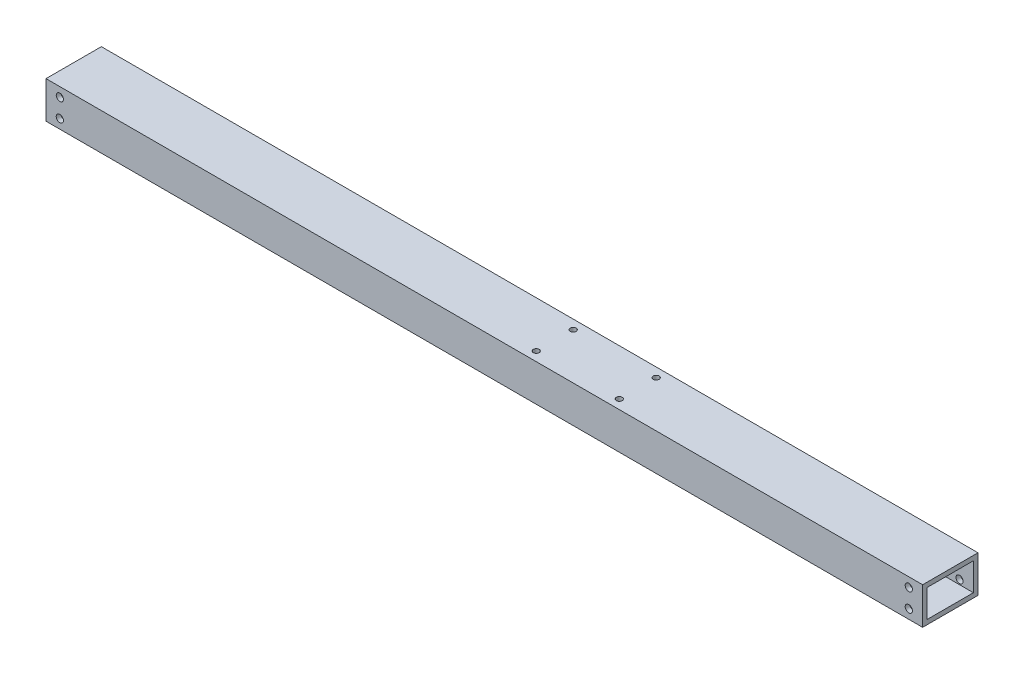
ISO-10303-21;
HEADER;
FILE_DESCRIPTION(('STEP AP214'),'2;1');
FILE_NAME('part.step','',(''),(''),'','','');
FILE_SCHEMA(('AUTOMOTIVE_DESIGN { 1 0 10303 214 1 1 1 1 }'));
ENDSEC;
DATA;
#1=APPLICATION_CONTEXT('core data for automotive mechanical design processes');
#2=APPLICATION_PROTOCOL_DEFINITION('international standard','automotive_design',2000,#1);
#3=PRODUCT_CONTEXT('',#1,'mechanical');
#4=PRODUCT('Part','Part','',(#3));
#5=PRODUCT_RELATED_PRODUCT_CATEGORY('part','',(#4));
#6=PRODUCT_DEFINITION_FORMATION('','',#4);
#7=PRODUCT_DEFINITION_CONTEXT('part definition',#1,'design');
#8=PRODUCT_DEFINITION('design','',#6,#7);
#9=PRODUCT_DEFINITION_SHAPE('','',#8);
#10=(LENGTH_UNIT() NAMED_UNIT(*) SI_UNIT(.MILLI.,.METRE.));
#11=(NAMED_UNIT(*) PLANE_ANGLE_UNIT() SI_UNIT($,.RADIAN.));
#12=(NAMED_UNIT(*) SI_UNIT($,.STERADIAN.) SOLID_ANGLE_UNIT());
#13=UNCERTAINTY_MEASURE_WITH_UNIT(LENGTH_MEASURE(1.E-05),#10,'distance_accuracy_value','');
#14=(GEOMETRIC_REPRESENTATION_CONTEXT(3) GLOBAL_UNCERTAINTY_ASSIGNED_CONTEXT((#13)) GLOBAL_UNIT_ASSIGNED_CONTEXT((#10,
#11,#12)) REPRESENTATION_CONTEXT('',''));
#15=CARTESIAN_POINT('',(0.,0.,0.));
#16=DIRECTION('',(0.,0.,1.));
#17=DIRECTION('',(1.,0.,0.));
#18=AXIS2_PLACEMENT_3D('',#15,#16,#17);
#19=CARTESIAN_POINT('',(301.625,0.,0.));
#20=DIRECTION('',(1.,0.,0.));
#21=DIRECTION('',(0.,0.,-1.));
#22=AXIS2_PLACEMENT_3D('',#19,#20,#21);
#23=PLANE('',#22);
#24=DIRECTION('',(0.,1.,0.));
#25=VECTOR('',#24,1.);
#26=CARTESIAN_POINT('',(301.625,12.7,-19.05));
#27=LINE('',#26,#25);
#28=CARTESIAN_POINT('',(301.625,-12.7,-19.05));
#29=VERTEX_POINT('',#28);
#30=CARTESIAN_POINT('',(301.625,12.7,-19.05));
#31=VERTEX_POINT('',#30);
#32=EDGE_CURVE('E139',#29,#31,#27,.T.);
#33=ORIENTED_EDGE('',*,*,#32,.T.);
#34=DIRECTION('',(0.,0.,1.));
#35=VECTOR('',#34,1.);
#36=CARTESIAN_POINT('',(301.625,12.7,19.05));
#37=LINE('',#36,#35);
#38=CARTESIAN_POINT('',(301.625,12.7,19.05));
#39=VERTEX_POINT('',#38);
#40=EDGE_CURVE('E142',#31,#39,#37,.T.);
#41=ORIENTED_EDGE('',*,*,#40,.T.);
#42=DIRECTION('',(0.,-1.,0.));
#43=VECTOR('',#42,1.);
#44=CARTESIAN_POINT('',(301.625,12.7,19.05));
#45=LINE('',#44,#43);
#46=CARTESIAN_POINT('',(301.625,-12.7,19.05));
#47=VERTEX_POINT('',#46);
#48=EDGE_CURVE('E145',#39,#47,#45,.T.);
#49=ORIENTED_EDGE('',*,*,#48,.T.);
#50=DIRECTION('',(0.,0.,-1.));
#51=VECTOR('',#50,1.);
#52=CARTESIAN_POINT('',(301.625,-12.7,19.05));
#53=LINE('',#52,#51);
#54=EDGE_CURVE('E147',#47,#29,#53,.T.);
#55=ORIENTED_EDGE('',*,*,#54,.T.);
#56=EDGE_LOOP('',(#33,#41,#49,#55));
#57=FACE_BOUND('',#56,.T.);
#58=DIRECTION('',(0.,-1.,0.));
#59=VECTOR('',#58,1.);
#60=CARTESIAN_POINT('',(301.625,9.525,15.875));
#61=LINE('',#60,#59);
#62=CARTESIAN_POINT('',(301.625,9.525,15.875));
#63=VERTEX_POINT('',#62);
#64=CARTESIAN_POINT('',(301.625,-9.525,15.875));
#65=VERTEX_POINT('',#64);
#66=EDGE_CURVE('E109',#63,#65,#61,.T.);
#67=ORIENTED_EDGE('',*,*,#66,.F.);
#68=DIRECTION('',(0.,0.,1.));
#69=VECTOR('',#68,1.);
#70=CARTESIAN_POINT('',(301.625,9.525,15.875));
#71=LINE('',#70,#69);
#72=CARTESIAN_POINT('',(301.625,9.525,-15.875));
#73=VERTEX_POINT('',#72);
#74=EDGE_CURVE('E101',#73,#63,#71,.T.);
#75=ORIENTED_EDGE('',*,*,#74,.F.);
#76=DIRECTION('',(0.,1.,0.));
#77=VECTOR('',#76,1.);
#78=CARTESIAN_POINT('',(301.625,9.525,-15.875));
#79=LINE('',#78,#77);
#80=CARTESIAN_POINT('',(301.625,-9.525,-15.875));
#81=VERTEX_POINT('',#80);
#82=EDGE_CURVE('E123',#81,#73,#79,.T.);
#83=ORIENTED_EDGE('',*,*,#82,.F.);
#84=DIRECTION('',(0.,0.,-1.));
#85=VECTOR('',#84,1.);
#86=CARTESIAN_POINT('',(301.625,-9.525,15.875));
#87=LINE('',#86,#85);
#88=EDGE_CURVE('E121',#65,#81,#87,.T.);
#89=ORIENTED_EDGE('',*,*,#88,.F.);
#90=EDGE_LOOP('',(#67,#75,#83,#89));
#91=FACE_BOUND('',#90,.T.);
#92=ADVANCED_FACE('F34',(#57,#91),#23,.T.);
#93=CARTESIAN_POINT('',(-301.625,0.,0.));
#94=DIRECTION('',(1.,0.,0.));
#95=DIRECTION('',(0.,0.,-1.));
#96=AXIS2_PLACEMENT_3D('',#93,#94,#95);
#97=PLANE('',#96);
#98=DIRECTION('',(0.,1.,0.));
#99=VECTOR('',#98,1.);
#100=CARTESIAN_POINT('',(-301.625,12.7,-19.05));
#101=LINE('',#100,#99);
#102=CARTESIAN_POINT('',(-301.625,-12.7,-19.05));
#103=VERTEX_POINT('',#102);
#104=CARTESIAN_POINT('',(-301.625,12.7,-19.05));
#105=VERTEX_POINT('',#104);
#106=EDGE_CURVE('E117',#103,#105,#101,.T.);
#107=ORIENTED_EDGE('',*,*,#106,.F.);
#108=DIRECTION('',(0.,0.,-1.));
#109=VECTOR('',#108,1.);
#110=CARTESIAN_POINT('',(-301.625,-12.7,19.05));
#111=LINE('',#110,#109);
#112=CARTESIAN_POINT('',(-301.625,-12.7,19.05));
#113=VERTEX_POINT('',#112);
#114=EDGE_CURVE('E143',#113,#103,#111,.T.);
#115=ORIENTED_EDGE('',*,*,#114,.F.);
#116=DIRECTION('',(0.,-1.,0.));
#117=VECTOR('',#116,1.);
#118=CARTESIAN_POINT('',(-301.625,12.7,19.05));
#119=LINE('',#118,#117);
#120=CARTESIAN_POINT('',(-301.625,12.7,19.05));
#121=VERTEX_POINT('',#120);
#122=EDGE_CURVE('E154',#121,#113,#119,.T.);
#123=ORIENTED_EDGE('',*,*,#122,.F.);
#124=DIRECTION('',(0.,0.,1.));
#125=VECTOR('',#124,1.);
#126=CARTESIAN_POINT('',(-301.625,12.7,19.05));
#127=LINE('',#126,#125);
#128=EDGE_CURVE('E152',#105,#121,#127,.T.);
#129=ORIENTED_EDGE('',*,*,#128,.F.);
#130=EDGE_LOOP('',(#107,#115,#123,#129));
#131=FACE_BOUND('',#130,.T.);
#132=DIRECTION('',(0.,0.,1.));
#133=VECTOR('',#132,1.);
#134=CARTESIAN_POINT('',(-301.625,9.525,15.875));
#135=LINE('',#134,#133);
#136=CARTESIAN_POINT('',(-301.625,9.525,-15.875));
#137=VERTEX_POINT('',#136);
#138=CARTESIAN_POINT('',(-301.625,9.525,15.875));
#139=VERTEX_POINT('',#138);
#140=EDGE_CURVE('E59',#137,#139,#135,.T.);
#141=ORIENTED_EDGE('',*,*,#140,.T.);
#142=DIRECTION('',(0.,-1.,0.));
#143=VECTOR('',#142,1.);
#144=CARTESIAN_POINT('',(-301.625,9.525,15.875));
#145=LINE('',#144,#143);
#146=CARTESIAN_POINT('',(-301.625,-9.525,15.875));
#147=VERTEX_POINT('',#146);
#148=EDGE_CURVE('E116',#139,#147,#145,.T.);
#149=ORIENTED_EDGE('',*,*,#148,.T.);
#150=DIRECTION('',(0.,0.,-1.));
#151=VECTOR('',#150,1.);
#152=CARTESIAN_POINT('',(-301.625,-9.525,15.875));
#153=LINE('',#152,#151);
#154=CARTESIAN_POINT('',(-301.625,-9.525,-15.875));
#155=VERTEX_POINT('',#154);
#156=EDGE_CURVE('E131',#147,#155,#153,.T.);
#157=ORIENTED_EDGE('',*,*,#156,.T.);
#158=DIRECTION('',(0.,1.,0.));
#159=VECTOR('',#158,1.);
#160=CARTESIAN_POINT('',(-301.625,9.525,-15.875));
#161=LINE('',#160,#159);
#162=EDGE_CURVE('E110',#155,#137,#161,.T.);
#163=ORIENTED_EDGE('',*,*,#162,.T.);
#164=EDGE_LOOP('',(#141,#149,#157,#163));
#165=FACE_BOUND('',#164,.T.);
#166=ADVANCED_FACE('F271',(#131,#165),#97,.F.);
#167=CARTESIAN_POINT('',(301.625,12.7,-19.05));
#168=DIRECTION('',(0.,0.,1.));
#169=DIRECTION('',(0.,-1.,0.));
#170=AXIS2_PLACEMENT_3D('',#167,#168,#169);
#171=PLANE('',#170);
#172=CARTESIAN_POINT('',(292.1,6.35,-19.05));
#173=DIRECTION('',(0.,0.,-1.));
#174=DIRECTION('',(-1.,0.,0.));
#175=AXIS2_PLACEMENT_3D('',#172,#173,#174);
#176=CIRCLE('',#175,2.48920000000001);
#177=CARTESIAN_POINT('',(289.6108,6.35,-19.05));
#178=VERTEX_POINT('',#177);
#179=EDGE_CURVE('E176',#178,#178,#176,.T.);
#180=ORIENTED_EDGE('',*,*,#179,.F.);
#181=EDGE_LOOP('',(#180));
#182=FACE_BOUND('',#181,.T.);
#183=CARTESIAN_POINT('',(292.1,-6.35,-19.05));
#184=DIRECTION('',(0.,0.,-1.));
#185=DIRECTION('',(-1.,0.,0.));
#186=AXIS2_PLACEMENT_3D('',#183,#184,#185);
#187=CIRCLE('',#186,2.48920000000001);
#188=CARTESIAN_POINT('',(289.6108,-6.35,-19.05));
#189=VERTEX_POINT('',#188);
#190=EDGE_CURVE('E212',#189,#189,#187,.T.);
#191=ORIENTED_EDGE('',*,*,#190,.F.);
#192=EDGE_LOOP('',(#191));
#193=FACE_BOUND('',#192,.T.);
#194=CARTESIAN_POINT('',(-292.1,6.35,-19.05));
#195=DIRECTION('',(0.,0.,1.));
#196=DIRECTION('',(1.,0.,0.));
#197=AXIS2_PLACEMENT_3D('',#194,#195,#196);
#198=CIRCLE('',#197,2.48920000000001);
#199=CARTESIAN_POINT('',(-289.6108,6.35,-19.05));
#200=VERTEX_POINT('',#199);
#201=EDGE_CURVE('E168',#200,#200,#198,.T.);
#202=ORIENTED_EDGE('',*,*,#201,.T.);
#203=EDGE_LOOP('',(#202));
#204=FACE_BOUND('',#203,.T.);
#205=CARTESIAN_POINT('',(-292.1,-6.35,-19.05));
#206=DIRECTION('',(0.,0.,1.));
#207=DIRECTION('',(1.,0.,0.));
#208=AXIS2_PLACEMENT_3D('',#205,#206,#207);
#209=CIRCLE('',#208,2.48920000000001);
#210=CARTESIAN_POINT('',(-289.6108,-6.35,-19.05));
#211=VERTEX_POINT('',#210);
#212=EDGE_CURVE('E227',#211,#211,#209,.T.);
#213=ORIENTED_EDGE('',*,*,#212,.T.);
#214=EDGE_LOOP('',(#213));
#215=FACE_BOUND('',#214,.T.);
#216=ORIENTED_EDGE('',*,*,#106,.T.);
#217=DIRECTION('',(-1.,0.,0.));
#218=VECTOR('',#217,1.);
#219=CARTESIAN_POINT('',(301.625,12.7,-19.05));
#220=LINE('',#219,#218);
#221=EDGE_CURVE('E11',#31,#105,#220,.T.);
#222=ORIENTED_EDGE('',*,*,#221,.F.);
#223=ORIENTED_EDGE('',*,*,#32,.F.);
#224=DIRECTION('',(-1.,0.,0.));
#225=VECTOR('',#224,1.);
#226=CARTESIAN_POINT('',(301.625,-12.7,-19.05));
#227=LINE('',#226,#225);
#228=EDGE_CURVE('E149',#29,#103,#227,.T.);
#229=ORIENTED_EDGE('',*,*,#228,.T.);
#230=EDGE_LOOP('',(#216,#222,#223,#229));
#231=FACE_BOUND('',#230,.T.);
#232=ADVANCED_FACE('F36',(#182,#193,#204,#215,#231),#171,.F.);
#233=CARTESIAN_POINT('',(301.625,12.7,19.05));
#234=DIRECTION('',(0.,-1.,0.));
#235=DIRECTION('',(0.,0.,-1.));
#236=AXIS2_PLACEMENT_3D('',#233,#234,#235);
#237=PLANE('',#236);
#238=CARTESIAN_POINT('',(29.4002000000002,12.7,-12.7));
#239=DIRECTION('',(0.,-1.,0.));
#240=DIRECTION('',(0.,0.,-1.));
#241=AXIS2_PLACEMENT_3D('',#238,#239,#240);
#242=CIRCLE('',#241,2.01930000000001);
#243=CARTESIAN_POINT('',(29.4002000000002,12.7,-14.7193));
#244=VERTEX_POINT('',#243);
#245=EDGE_CURVE('E323',#244,#244,#242,.T.);
#246=ORIENTED_EDGE('',*,*,#245,.T.);
#247=EDGE_LOOP('',(#246));
#248=FACE_BOUND('',#247,.T.);
#249=CARTESIAN_POINT('',(29.4002000000002,12.7,12.7));
#250=DIRECTION('',(0.,-1.,0.));
#251=DIRECTION('',(0.,0.,-1.));
#252=AXIS2_PLACEMENT_3D('',#249,#250,#251);
#253=CIRCLE('',#252,2.01930000000001);
#254=CARTESIAN_POINT('',(29.4002000000002,12.7,10.6807));
#255=VERTEX_POINT('',#254);
#256=EDGE_CURVE('E326',#255,#255,#253,.T.);
#257=ORIENTED_EDGE('',*,*,#256,.T.);
#258=EDGE_LOOP('',(#257));
#259=FACE_BOUND('',#258,.T.);
#260=CARTESIAN_POINT('',(86.5502000000002,12.7,12.7));
#261=DIRECTION('',(0.,-1.,0.));
#262=DIRECTION('',(0.,0.,-1.));
#263=AXIS2_PLACEMENT_3D('',#260,#261,#262);
#264=CIRCLE('',#263,2.01929999999986);
#265=CARTESIAN_POINT('',(86.5502000000002,12.7,10.6807000000001));
#266=VERTEX_POINT('',#265);
#267=EDGE_CURVE('E316',#266,#266,#264,.T.);
#268=ORIENTED_EDGE('',*,*,#267,.T.);
#269=EDGE_LOOP('',(#268));
#270=FACE_BOUND('',#269,.T.);
#271=CARTESIAN_POINT('',(86.5502000000002,12.7,-12.7));
#272=DIRECTION('',(0.,-1.,0.));
#273=DIRECTION('',(0.,0.,-1.));
#274=AXIS2_PLACEMENT_3D('',#271,#272,#273);
#275=CIRCLE('',#274,2.01929999999986);
#276=CARTESIAN_POINT('',(86.5502000000002,12.7,-14.7192999999999));
#277=VERTEX_POINT('',#276);
#278=EDGE_CURVE('E185',#277,#277,#275,.T.);
#279=ORIENTED_EDGE('',*,*,#278,.T.);
#280=EDGE_LOOP('',(#279));
#281=FACE_BOUND('',#280,.T.);
#282=ORIENTED_EDGE('',*,*,#128,.T.);
#283=DIRECTION('',(-1.,0.,0.));
#284=VECTOR('',#283,1.);
#285=CARTESIAN_POINT('',(301.625,12.7,19.05));
#286=LINE('',#285,#284);
#287=EDGE_CURVE('E43',#39,#121,#286,.T.);
#288=ORIENTED_EDGE('',*,*,#287,.F.);
#289=ORIENTED_EDGE('',*,*,#40,.F.);
#290=ORIENTED_EDGE('',*,*,#221,.T.);
#291=EDGE_LOOP('',(#282,#288,#289,#290));
#292=FACE_BOUND('',#291,.T.);
#293=ADVANCED_FACE('F258',(#248,#259,#270,#281,#292),#237,.F.);
#294=CARTESIAN_POINT('',(301.625,12.7,19.05));
#295=DIRECTION('',(0.,0.,-1.));
#296=DIRECTION('',(-1.,0.,0.));
#297=AXIS2_PLACEMENT_3D('',#294,#295,#296);
#298=PLANE('',#297);
#299=CARTESIAN_POINT('',(292.1,6.35,19.05));
#300=DIRECTION('',(0.,0.,-1.));
#301=DIRECTION('',(-1.,0.,0.));
#302=AXIS2_PLACEMENT_3D('',#299,#300,#301);
#303=CIRCLE('',#302,2.48920000000001);
#304=CARTESIAN_POINT('',(289.6108,6.35,19.05));
#305=VERTEX_POINT('',#304);
#306=EDGE_CURVE('E209',#305,#305,#303,.T.);
#307=ORIENTED_EDGE('',*,*,#306,.T.);
#308=EDGE_LOOP('',(#307));
#309=FACE_BOUND('',#308,.T.);
#310=CARTESIAN_POINT('',(292.1,-6.35,19.05));
#311=DIRECTION('',(0.,0.,-1.));
#312=DIRECTION('',(-1.,0.,0.));
#313=AXIS2_PLACEMENT_3D('',#310,#311,#312);
#314=CIRCLE('',#313,2.48920000000001);
#315=CARTESIAN_POINT('',(289.6108,-6.35,19.05));
#316=VERTEX_POINT('',#315);
#317=EDGE_CURVE('E206',#316,#316,#314,.T.);
#318=ORIENTED_EDGE('',*,*,#317,.T.);
#319=EDGE_LOOP('',(#318));
#320=FACE_BOUND('',#319,.T.);
#321=CARTESIAN_POINT('',(-292.1,6.35,19.05));
#322=DIRECTION('',(0.,0.,1.));
#323=DIRECTION('',(1.,0.,0.));
#324=AXIS2_PLACEMENT_3D('',#321,#322,#323);
#325=CIRCLE('',#324,2.48920000000001);
#326=CARTESIAN_POINT('',(-289.6108,6.35,19.05));
#327=VERTEX_POINT('',#326);
#328=EDGE_CURVE('E224',#327,#327,#325,.T.);
#329=ORIENTED_EDGE('',*,*,#328,.F.);
#330=EDGE_LOOP('',(#329));
#331=FACE_BOUND('',#330,.T.);
#332=CARTESIAN_POINT('',(-292.1,-6.35,19.05));
#333=DIRECTION('',(0.,0.,1.));
#334=DIRECTION('',(1.,0.,0.));
#335=AXIS2_PLACEMENT_3D('',#332,#333,#334);
#336=CIRCLE('',#335,2.48920000000001);
#337=CARTESIAN_POINT('',(-289.6108,-6.35,19.05));
#338=VERTEX_POINT('',#337);
#339=EDGE_CURVE('E221',#338,#338,#336,.T.);
#340=ORIENTED_EDGE('',*,*,#339,.F.);
#341=EDGE_LOOP('',(#340));
#342=FACE_BOUND('',#341,.T.);
#343=ORIENTED_EDGE('',*,*,#122,.T.);
#344=DIRECTION('',(-1.,0.,0.));
#345=VECTOR('',#344,1.);
#346=CARTESIAN_POINT('',(301.625,-12.7,19.05));
#347=LINE('',#346,#345);
#348=EDGE_CURVE('E159',#47,#113,#347,.T.);
#349=ORIENTED_EDGE('',*,*,#348,.F.);
#350=ORIENTED_EDGE('',*,*,#48,.F.);
#351=ORIENTED_EDGE('',*,*,#287,.T.);
#352=EDGE_LOOP('',(#343,#349,#350,#351));
#353=FACE_BOUND('',#352,.T.);
#354=ADVANCED_FACE('F254',(#309,#320,#331,#342,#353),#298,.F.);
#355=CARTESIAN_POINT('',(301.625,-12.7,19.05));
#356=DIRECTION('',(0.,1.,0.));
#357=DIRECTION('',(0.,0.,1.));
#358=AXIS2_PLACEMENT_3D('',#355,#356,#357);
#359=PLANE('',#358);
#360=CARTESIAN_POINT('',(29.4002000000002,-12.7,-12.7));
#361=DIRECTION('',(0.,-1.,0.));
#362=DIRECTION('',(0.,0.,-1.));
#363=AXIS2_PLACEMENT_3D('',#360,#361,#362);
#364=CIRCLE('',#363,2.01930000000001);
#365=CARTESIAN_POINT('',(29.4002000000002,-12.7,-14.7193));
#366=VERTEX_POINT('',#365);
#367=EDGE_CURVE('E303',#366,#366,#364,.T.);
#368=ORIENTED_EDGE('',*,*,#367,.F.);
#369=EDGE_LOOP('',(#368));
#370=FACE_BOUND('',#369,.T.);
#371=CARTESIAN_POINT('',(29.4002000000002,-12.7,12.7));
#372=DIRECTION('',(0.,-1.,0.));
#373=DIRECTION('',(0.,0.,-1.));
#374=AXIS2_PLACEMENT_3D('',#371,#372,#373);
#375=CIRCLE('',#374,2.01930000000001);
#376=CARTESIAN_POINT('',(29.4002000000002,-12.7,10.6807));
#377=VERTEX_POINT('',#376);
#378=EDGE_CURVE('E307',#377,#377,#375,.T.);
#379=ORIENTED_EDGE('',*,*,#378,.F.);
#380=EDGE_LOOP('',(#379));
#381=FACE_BOUND('',#380,.T.);
#382=CARTESIAN_POINT('',(86.5502000000002,-12.7,12.7));
#383=DIRECTION('',(0.,-1.,0.));
#384=DIRECTION('',(0.,0.,-1.));
#385=AXIS2_PLACEMENT_3D('',#382,#383,#384);
#386=CIRCLE('',#385,2.01929999999986);
#387=CARTESIAN_POINT('',(86.5502000000002,-12.7,10.6807000000001));
#388=VERTEX_POINT('',#387);
#389=EDGE_CURVE('E311',#388,#388,#386,.T.);
#390=ORIENTED_EDGE('',*,*,#389,.F.);
#391=EDGE_LOOP('',(#390));
#392=FACE_BOUND('',#391,.T.);
#393=CARTESIAN_POINT('',(86.5502000000002,-12.7,-12.7));
#394=DIRECTION('',(0.,-1.,0.));
#395=DIRECTION('',(0.,0.,-1.));
#396=AXIS2_PLACEMENT_3D('',#393,#394,#395);
#397=CIRCLE('',#396,2.01929999999986);
#398=CARTESIAN_POINT('',(86.5502000000002,-12.7,-14.7192999999999));
#399=VERTEX_POINT('',#398);
#400=EDGE_CURVE('E314',#399,#399,#397,.T.);
#401=ORIENTED_EDGE('',*,*,#400,.F.);
#402=EDGE_LOOP('',(#401));
#403=FACE_BOUND('',#402,.T.);
#404=ORIENTED_EDGE('',*,*,#114,.T.);
#405=ORIENTED_EDGE('',*,*,#228,.F.);
#406=ORIENTED_EDGE('',*,*,#54,.F.);
#407=ORIENTED_EDGE('',*,*,#348,.T.);
#408=EDGE_LOOP('',(#404,#405,#406,#407));
#409=FACE_BOUND('',#408,.T.);
#410=ADVANCED_FACE('F257',(#370,#381,#392,#403,#409),#359,.F.);
#411=CARTESIAN_POINT('',(301.625,9.525,15.875));
#412=DIRECTION('',(0.,-1.,0.));
#413=DIRECTION('',(0.,0.,-1.));
#414=AXIS2_PLACEMENT_3D('',#411,#412,#413);
#415=PLANE('',#414);
#416=CARTESIAN_POINT('',(29.4002000000002,9.525,-12.7));
#417=DIRECTION('',(0.,-1.,0.));
#418=DIRECTION('',(0.,0.,-1.));
#419=AXIS2_PLACEMENT_3D('',#416,#417,#418);
#420=CIRCLE('',#419,2.01930000000001);
#421=CARTESIAN_POINT('',(29.4002000000002,9.525,-14.7193));
#422=VERTEX_POINT('',#421);
#423=EDGE_CURVE('E203',#422,#422,#420,.T.);
#424=ORIENTED_EDGE('',*,*,#423,.F.);
#425=EDGE_LOOP('',(#424));
#426=FACE_BOUND('',#425,.T.);
#427=CARTESIAN_POINT('',(29.4002000000002,9.525,12.7));
#428=DIRECTION('',(0.,-1.,0.));
#429=DIRECTION('',(0.,0.,-1.));
#430=AXIS2_PLACEMENT_3D('',#427,#428,#429);
#431=CIRCLE('',#430,2.01930000000001);
#432=CARTESIAN_POINT('',(29.4002000000002,9.525,10.6807));
#433=VERTEX_POINT('',#432);
#434=EDGE_CURVE('E191',#433,#433,#431,.T.);
#435=ORIENTED_EDGE('',*,*,#434,.F.);
#436=EDGE_LOOP('',(#435));
#437=FACE_BOUND('',#436,.T.);
#438=CARTESIAN_POINT('',(86.5502000000002,9.525,12.7));
#439=DIRECTION('',(0.,-1.,0.));
#440=DIRECTION('',(0.,0.,-1.));
#441=AXIS2_PLACEMENT_3D('',#438,#439,#440);
#442=CIRCLE('',#441,2.01929999999986);
#443=CARTESIAN_POINT('',(86.5502000000002,9.525,10.6807000000001));
#444=VERTEX_POINT('',#443);
#445=EDGE_CURVE('E188',#444,#444,#442,.T.);
#446=ORIENTED_EDGE('',*,*,#445,.F.);
#447=EDGE_LOOP('',(#446));
#448=FACE_BOUND('',#447,.T.);
#449=CARTESIAN_POINT('',(86.5502000000002,9.525,-12.7));
#450=DIRECTION('',(0.,-1.,0.));
#451=DIRECTION('',(0.,0.,-1.));
#452=AXIS2_PLACEMENT_3D('',#449,#450,#451);
#453=CIRCLE('',#452,2.01929999999986);
#454=CARTESIAN_POINT('',(86.5502000000002,9.525,-14.7192999999999));
#455=VERTEX_POINT('',#454);
#456=EDGE_CURVE('E184',#455,#455,#453,.T.);
#457=ORIENTED_EDGE('',*,*,#456,.F.);
#458=EDGE_LOOP('',(#457));
#459=FACE_BOUND('',#458,.T.);
#460=ORIENTED_EDGE('',*,*,#140,.F.);
#461=DIRECTION('',(-1.,0.,0.));
#462=VECTOR('',#461,1.);
#463=CARTESIAN_POINT('',(301.625,9.525,-15.875));
#464=LINE('',#463,#462);
#465=EDGE_CURVE('E105',#73,#137,#464,.T.);
#466=ORIENTED_EDGE('',*,*,#465,.F.);
#467=ORIENTED_EDGE('',*,*,#74,.T.);
#468=DIRECTION('',(-1.,0.,0.));
#469=VECTOR('',#468,1.);
#470=CARTESIAN_POINT('',(301.625,9.525,15.875));
#471=LINE('',#470,#469);
#472=EDGE_CURVE('E104',#63,#139,#471,.T.);
#473=ORIENTED_EDGE('',*,*,#472,.T.);
#474=EDGE_LOOP('',(#460,#466,#467,#473));
#475=FACE_BOUND('',#474,.T.);
#476=ADVANCED_FACE('F103',(#426,#437,#448,#459,#475),#415,.T.);
#477=CARTESIAN_POINT('',(301.625,9.525,15.875));
#478=DIRECTION('',(0.,0.,-1.));
#479=DIRECTION('',(0.,1.,0.));
#480=AXIS2_PLACEMENT_3D('',#477,#478,#479);
#481=PLANE('',#480);
#482=CARTESIAN_POINT('',(292.1,6.35,15.875));
#483=DIRECTION('',(0.,0.,-1.));
#484=DIRECTION('',(0.,1.,0.));
#485=AXIS2_PLACEMENT_3D('',#482,#483,#484);
#486=CIRCLE('',#485,2.48920000000001);
#487=CARTESIAN_POINT('',(292.1,8.83920000000001,15.875));
#488=VERTEX_POINT('',#487);
#489=EDGE_CURVE('E180',#488,#488,#486,.F.);
#490=ORIENTED_EDGE('',*,*,#489,.T.);
#491=EDGE_LOOP('',(#490));
#492=FACE_BOUND('',#491,.T.);
#493=CARTESIAN_POINT('',(292.1,-6.35,15.875));
#494=DIRECTION('',(0.,0.,-1.));
#495=DIRECTION('',(0.,1.,0.));
#496=AXIS2_PLACEMENT_3D('',#493,#494,#495);
#497=CIRCLE('',#496,2.48920000000001);
#498=CARTESIAN_POINT('',(292.1,-3.86079999999999,15.875));
#499=VERTEX_POINT('',#498);
#500=EDGE_CURVE('E175',#499,#499,#497,.F.);
#501=ORIENTED_EDGE('',*,*,#500,.T.);
#502=EDGE_LOOP('',(#501));
#503=FACE_BOUND('',#502,.T.);
#504=CARTESIAN_POINT('',(-292.1,6.35,15.875));
#505=DIRECTION('',(0.,0.,-1.));
#506=DIRECTION('',(0.,1.,0.));
#507=AXIS2_PLACEMENT_3D('',#504,#505,#506);
#508=CIRCLE('',#507,2.48920000000001);
#509=CARTESIAN_POINT('',(-292.1,8.83920000000001,15.875));
#510=VERTEX_POINT('',#509);
#511=EDGE_CURVE('E129',#510,#510,#508,.T.);
#512=ORIENTED_EDGE('',*,*,#511,.F.);
#513=EDGE_LOOP('',(#512));
#514=FACE_BOUND('',#513,.T.);
#515=CARTESIAN_POINT('',(-292.1,-6.35,15.875));
#516=DIRECTION('',(0.,0.,-1.));
#517=DIRECTION('',(0.,1.,0.));
#518=AXIS2_PLACEMENT_3D('',#515,#516,#517);
#519=CIRCLE('',#518,2.48920000000001);
#520=CARTESIAN_POINT('',(-292.1,-3.86079999999999,15.875));
#521=VERTEX_POINT('',#520);
#522=EDGE_CURVE('E167',#521,#521,#519,.T.);
#523=ORIENTED_EDGE('',*,*,#522,.F.);
#524=EDGE_LOOP('',(#523));
#525=FACE_BOUND('',#524,.T.);
#526=ORIENTED_EDGE('',*,*,#148,.F.);
#527=ORIENTED_EDGE('',*,*,#472,.F.);
#528=ORIENTED_EDGE('',*,*,#66,.T.);
#529=DIRECTION('',(-1.,0.,0.));
#530=VECTOR('',#529,1.);
#531=CARTESIAN_POINT('',(301.625,-9.525,15.875));
#532=LINE('',#531,#530);
#533=EDGE_CURVE('E118',#65,#147,#532,.T.);
#534=ORIENTED_EDGE('',*,*,#533,.T.);
#535=EDGE_LOOP('',(#526,#527,#528,#534));
#536=FACE_BOUND('',#535,.T.);
#537=ADVANCED_FACE('F113',(#492,#503,#514,#525,#536),#481,.T.);
#538=CARTESIAN_POINT('',(301.625,-9.525,15.875));
#539=DIRECTION('',(0.,1.,0.));
#540=DIRECTION('',(0.,0.,1.));
#541=AXIS2_PLACEMENT_3D('',#538,#539,#540);
#542=PLANE('',#541);
#543=CARTESIAN_POINT('',(29.4002000000002,-9.525,-12.7));
#544=DIRECTION('',(0.,1.,0.));
#545=DIRECTION('',(0.,0.,1.));
#546=AXIS2_PLACEMENT_3D('',#543,#544,#545);
#547=CIRCLE('',#546,2.01930000000001);
#548=CARTESIAN_POINT('',(29.4002000000002,-9.525,-10.6807));
#549=VERTEX_POINT('',#548);
#550=EDGE_CURVE('E38',#549,#549,#547,.T.);
#551=ORIENTED_EDGE('',*,*,#550,.F.);
#552=EDGE_LOOP('',(#551));
#553=FACE_BOUND('',#552,.T.);
#554=CARTESIAN_POINT('',(29.4002000000002,-9.525,12.7));
#555=DIRECTION('',(0.,1.,0.));
#556=DIRECTION('',(0.,0.,1.));
#557=AXIS2_PLACEMENT_3D('',#554,#555,#556);
#558=CIRCLE('',#557,2.01930000000001);
#559=CARTESIAN_POINT('',(29.4002000000002,-9.525,14.7193));
#560=VERTEX_POINT('',#559);
#561=EDGE_CURVE('E189',#560,#560,#558,.T.);
#562=ORIENTED_EDGE('',*,*,#561,.F.);
#563=EDGE_LOOP('',(#562));
#564=FACE_BOUND('',#563,.T.);
#565=CARTESIAN_POINT('',(86.5502000000002,-9.525,12.7));
#566=DIRECTION('',(0.,1.,0.));
#567=DIRECTION('',(0.,0.,1.));
#568=AXIS2_PLACEMENT_3D('',#565,#566,#567);
#569=CIRCLE('',#568,2.01929999999986);
#570=CARTESIAN_POINT('',(86.5502000000002,-9.525,14.7192999999999));
#571=VERTEX_POINT('',#570);
#572=EDGE_CURVE('E186',#571,#571,#569,.T.);
#573=ORIENTED_EDGE('',*,*,#572,.F.);
#574=EDGE_LOOP('',(#573));
#575=FACE_BOUND('',#574,.T.);
#576=CARTESIAN_POINT('',(86.5502000000002,-9.525,-12.7));
#577=DIRECTION('',(0.,1.,0.));
#578=DIRECTION('',(0.,0.,1.));
#579=AXIS2_PLACEMENT_3D('',#576,#577,#578);
#580=CIRCLE('',#579,2.01929999999986);
#581=CARTESIAN_POINT('',(86.5502000000002,-9.525,-10.6807000000001));
#582=VERTEX_POINT('',#581);
#583=EDGE_CURVE('E181',#582,#582,#580,.T.);
#584=ORIENTED_EDGE('',*,*,#583,.F.);
#585=EDGE_LOOP('',(#584));
#586=FACE_BOUND('',#585,.T.);
#587=ORIENTED_EDGE('',*,*,#156,.F.);
#588=ORIENTED_EDGE('',*,*,#533,.F.);
#589=ORIENTED_EDGE('',*,*,#88,.T.);
#590=DIRECTION('',(-1.,0.,0.));
#591=VECTOR('',#590,1.);
#592=CARTESIAN_POINT('',(301.625,-9.525,-15.875));
#593=LINE('',#592,#591);
#594=EDGE_CURVE('E51',#81,#155,#593,.T.);
#595=ORIENTED_EDGE('',*,*,#594,.T.);
#596=EDGE_LOOP('',(#587,#588,#589,#595));
#597=FACE_BOUND('',#596,.T.);
#598=ADVANCED_FACE('F241',(#553,#564,#575,#586,#597),#542,.T.);
#599=CARTESIAN_POINT('',(301.625,9.525,-15.875));
#600=DIRECTION('',(0.,0.,1.));
#601=DIRECTION('',(0.,-1.,0.));
#602=AXIS2_PLACEMENT_3D('',#599,#600,#601);
#603=PLANE('',#602);
#604=CARTESIAN_POINT('',(292.1,6.35,-15.875));
#605=DIRECTION('',(0.,0.,1.));
#606=DIRECTION('',(0.,-1.,0.));
#607=AXIS2_PLACEMENT_3D('',#604,#605,#606);
#608=CIRCLE('',#607,2.48920000000001);
#609=CARTESIAN_POINT('',(292.1,3.8608,-15.875));
#610=VERTEX_POINT('',#609);
#611=EDGE_CURVE('E177',#610,#610,#608,.F.);
#612=ORIENTED_EDGE('',*,*,#611,.T.);
#613=EDGE_LOOP('',(#612));
#614=FACE_BOUND('',#613,.T.);
#615=CARTESIAN_POINT('',(292.1,-6.35,-15.875));
#616=DIRECTION('',(0.,0.,1.));
#617=DIRECTION('',(0.,-1.,0.));
#618=AXIS2_PLACEMENT_3D('',#615,#616,#617);
#619=CIRCLE('',#618,2.48920000000001);
#620=CARTESIAN_POINT('',(292.1,-8.8392,-15.875));
#621=VERTEX_POINT('',#620);
#622=EDGE_CURVE('E172',#621,#621,#619,.F.);
#623=ORIENTED_EDGE('',*,*,#622,.T.);
#624=EDGE_LOOP('',(#623));
#625=FACE_BOUND('',#624,.T.);
#626=CARTESIAN_POINT('',(-292.1,6.35,-15.875));
#627=DIRECTION('',(0.,0.,1.));
#628=DIRECTION('',(0.,-1.,0.));
#629=AXIS2_PLACEMENT_3D('',#626,#627,#628);
#630=CIRCLE('',#629,2.48920000000001);
#631=CARTESIAN_POINT('',(-292.1,3.8608,-15.875));
#632=VERTEX_POINT('',#631);
#633=EDGE_CURVE('E169',#632,#632,#630,.T.);
#634=ORIENTED_EDGE('',*,*,#633,.F.);
#635=EDGE_LOOP('',(#634));
#636=FACE_BOUND('',#635,.T.);
#637=CARTESIAN_POINT('',(-292.1,-6.35,-15.875));
#638=DIRECTION('',(0.,0.,1.));
#639=DIRECTION('',(0.,-1.,0.));
#640=AXIS2_PLACEMENT_3D('',#637,#638,#639);
#641=CIRCLE('',#640,2.48920000000001);
#642=CARTESIAN_POINT('',(-292.1,-8.8392,-15.875));
#643=VERTEX_POINT('',#642);
#644=EDGE_CURVE('E164',#643,#643,#641,.T.);
#645=ORIENTED_EDGE('',*,*,#644,.F.);
#646=EDGE_LOOP('',(#645));
#647=FACE_BOUND('',#646,.T.);
#648=ORIENTED_EDGE('',*,*,#162,.F.);
#649=ORIENTED_EDGE('',*,*,#594,.F.);
#650=ORIENTED_EDGE('',*,*,#82,.T.);
#651=ORIENTED_EDGE('',*,*,#465,.T.);
#652=EDGE_LOOP('',(#648,#649,#650,#651));
#653=FACE_BOUND('',#652,.T.);
#654=ADVANCED_FACE('F382',(#614,#625,#636,#647,#653),#603,.T.);
#655=CARTESIAN_POINT('',(-292.1,-6.35,-19.05));
#656=DIRECTION('',(0.,0.,1.));
#657=DIRECTION('',(1.,0.,0.));
#658=AXIS2_PLACEMENT_3D('',#655,#656,#657);
#659=CYLINDRICAL_SURFACE('',#658,2.48920000000001);
#660=ORIENTED_EDGE('',*,*,#644,.T.);
#661=EDGE_LOOP('',(#660));
#662=FACE_BOUND('',#661,.T.);
#663=ORIENTED_EDGE('',*,*,#212,.F.);
#664=EDGE_LOOP('',(#663));
#665=FACE_BOUND('',#664,.T.);
#666=ADVANCED_FACE('F251',(#662,#665),#659,.F.);
#667=CARTESIAN_POINT('',(-292.1,6.35,-19.05));
#668=DIRECTION('',(0.,0.,1.));
#669=DIRECTION('',(1.,0.,0.));
#670=AXIS2_PLACEMENT_3D('',#667,#668,#669);
#671=CYLINDRICAL_SURFACE('',#670,2.48920000000001);
#672=ORIENTED_EDGE('',*,*,#633,.T.);
#673=EDGE_LOOP('',(#672));
#674=FACE_BOUND('',#673,.T.);
#675=ORIENTED_EDGE('',*,*,#201,.F.);
#676=EDGE_LOOP('',(#675));
#677=FACE_BOUND('',#676,.T.);
#678=ADVANCED_FACE('F249',(#674,#677),#671,.F.);
#679=ORIENTED_EDGE('',*,*,#522,.T.);
#680=EDGE_LOOP('',(#679));
#681=FACE_BOUND('',#680,.T.);
#682=ORIENTED_EDGE('',*,*,#339,.T.);
#683=EDGE_LOOP('',(#682));
#684=FACE_BOUND('',#683,.T.);
#685=ADVANCED_FACE('F246',(#681,#684),#659,.F.);
#686=ORIENTED_EDGE('',*,*,#511,.T.);
#687=EDGE_LOOP('',(#686));
#688=FACE_BOUND('',#687,.T.);
#689=ORIENTED_EDGE('',*,*,#328,.T.);
#690=EDGE_LOOP('',(#689));
#691=FACE_BOUND('',#690,.T.);
#692=ADVANCED_FACE('F236',(#688,#691),#671,.F.);
#693=CARTESIAN_POINT('',(292.1,-6.35,-19.05));
#694=DIRECTION('',(0.,0.,1.));
#695=DIRECTION('',(1.,0.,0.));
#696=AXIS2_PLACEMENT_3D('',#693,#694,#695);
#697=CYLINDRICAL_SURFACE('',#696,2.48920000000001);
#698=ORIENTED_EDGE('',*,*,#622,.F.);
#699=EDGE_LOOP('',(#698));
#700=FACE_BOUND('',#699,.T.);
#701=ORIENTED_EDGE('',*,*,#190,.T.);
#702=EDGE_LOOP('',(#701));
#703=FACE_BOUND('',#702,.T.);
#704=ADVANCED_FACE('F373',(#700,#703),#697,.F.);
#705=CARTESIAN_POINT('',(292.1,6.35,-19.05));
#706=DIRECTION('',(0.,0.,1.));
#707=DIRECTION('',(1.,0.,0.));
#708=AXIS2_PLACEMENT_3D('',#705,#706,#707);
#709=CYLINDRICAL_SURFACE('',#708,2.48920000000001);
#710=ORIENTED_EDGE('',*,*,#611,.F.);
#711=EDGE_LOOP('',(#710));
#712=FACE_BOUND('',#711,.T.);
#713=ORIENTED_EDGE('',*,*,#179,.T.);
#714=EDGE_LOOP('',(#713));
#715=FACE_BOUND('',#714,.T.);
#716=ADVANCED_FACE('F369',(#712,#715),#709,.F.);
#717=ORIENTED_EDGE('',*,*,#500,.F.);
#718=EDGE_LOOP('',(#717));
#719=FACE_BOUND('',#718,.T.);
#720=ORIENTED_EDGE('',*,*,#317,.F.);
#721=EDGE_LOOP('',(#720));
#722=FACE_BOUND('',#721,.T.);
#723=ADVANCED_FACE('F372',(#719,#722),#697,.F.);
#724=ORIENTED_EDGE('',*,*,#489,.F.);
#725=EDGE_LOOP('',(#724));
#726=FACE_BOUND('',#725,.T.);
#727=ORIENTED_EDGE('',*,*,#306,.F.);
#728=EDGE_LOOP('',(#727));
#729=FACE_BOUND('',#728,.T.);
#730=ADVANCED_FACE('F344',(#726,#729),#709,.F.);
#731=CARTESIAN_POINT('',(86.5502000000002,12.7,-12.7));
#732=DIRECTION('',(0.,-1.,0.));
#733=DIRECTION('',(0.,0.,-1.));
#734=AXIS2_PLACEMENT_3D('',#731,#732,#733);
#735=CYLINDRICAL_SURFACE('',#734,2.01929999999986);
#736=ORIENTED_EDGE('',*,*,#583,.T.);
#737=EDGE_LOOP('',(#736));
#738=FACE_BOUND('',#737,.T.);
#739=ORIENTED_EDGE('',*,*,#400,.T.);
#740=EDGE_LOOP('',(#739));
#741=FACE_BOUND('',#740,.T.);
#742=ADVANCED_FACE('F333',(#738,#741),#735,.F.);
#743=CARTESIAN_POINT('',(86.5502000000002,12.7,12.7));
#744=DIRECTION('',(0.,-1.,0.));
#745=DIRECTION('',(0.,0.,-1.));
#746=AXIS2_PLACEMENT_3D('',#743,#744,#745);
#747=CYLINDRICAL_SURFACE('',#746,2.01929999999986);
#748=ORIENTED_EDGE('',*,*,#572,.T.);
#749=EDGE_LOOP('',(#748));
#750=FACE_BOUND('',#749,.T.);
#751=ORIENTED_EDGE('',*,*,#389,.T.);
#752=EDGE_LOOP('',(#751));
#753=FACE_BOUND('',#752,.T.);
#754=ADVANCED_FACE('F330',(#750,#753),#747,.F.);
#755=CARTESIAN_POINT('',(29.4002000000002,12.7,12.7));
#756=DIRECTION('',(0.,-1.,0.));
#757=DIRECTION('',(0.,0.,-1.));
#758=AXIS2_PLACEMENT_3D('',#755,#756,#757);
#759=CYLINDRICAL_SURFACE('',#758,2.01930000000001);
#760=ORIENTED_EDGE('',*,*,#561,.T.);
#761=EDGE_LOOP('',(#760));
#762=FACE_BOUND('',#761,.T.);
#763=ORIENTED_EDGE('',*,*,#378,.T.);
#764=EDGE_LOOP('',(#763));
#765=FACE_BOUND('',#764,.T.);
#766=ADVANCED_FACE('F332',(#762,#765),#759,.F.);
#767=CARTESIAN_POINT('',(29.4002000000002,12.7,-12.7));
#768=DIRECTION('',(0.,-1.,0.));
#769=DIRECTION('',(0.,0.,-1.));
#770=AXIS2_PLACEMENT_3D('',#767,#768,#769);
#771=CYLINDRICAL_SURFACE('',#770,2.01930000000001);
#772=ORIENTED_EDGE('',*,*,#550,.T.);
#773=EDGE_LOOP('',(#772));
#774=FACE_BOUND('',#773,.T.);
#775=ORIENTED_EDGE('',*,*,#367,.T.);
#776=EDGE_LOOP('',(#775));
#777=FACE_BOUND('',#776,.T.);
#778=ADVANCED_FACE('F341',(#774,#777),#771,.F.);
#779=ORIENTED_EDGE('',*,*,#456,.T.);
#780=EDGE_LOOP('',(#779));
#781=FACE_BOUND('',#780,.T.);
#782=ORIENTED_EDGE('',*,*,#278,.F.);
#783=EDGE_LOOP('',(#782));
#784=FACE_BOUND('',#783,.T.);
#785=ADVANCED_FACE('F347',(#781,#784),#735,.F.);
#786=ORIENTED_EDGE('',*,*,#445,.T.);
#787=EDGE_LOOP('',(#786));
#788=FACE_BOUND('',#787,.T.);
#789=ORIENTED_EDGE('',*,*,#267,.F.);
#790=EDGE_LOOP('',(#789));
#791=FACE_BOUND('',#790,.T.);
#792=ADVANCED_FACE('F336',(#788,#791),#747,.F.);
#793=ORIENTED_EDGE('',*,*,#434,.T.);
#794=EDGE_LOOP('',(#793));
#795=FACE_BOUND('',#794,.T.);
#796=ORIENTED_EDGE('',*,*,#256,.F.);
#797=EDGE_LOOP('',(#796));
#798=FACE_BOUND('',#797,.T.);
#799=ADVANCED_FACE('F343',(#795,#798),#759,.F.);
#800=ORIENTED_EDGE('',*,*,#423,.T.);
#801=EDGE_LOOP('',(#800));
#802=FACE_BOUND('',#801,.T.);
#803=ORIENTED_EDGE('',*,*,#245,.F.);
#804=EDGE_LOOP('',(#803));
#805=FACE_BOUND('',#804,.T.);
#806=ADVANCED_FACE('F353',(#802,#805),#771,.F.);
#807=CLOSED_SHELL('',(#92,#166,#232,#293,#354,#410,#476,#537,#598,#654,#666,#678,#685,#692,#704,
#716,#723,#730,#742,#754,#766,#778,#785,#792,#799,#806));
#808=MANIFOLD_SOLID_BREP('B2',#807);
#809=ADVANCED_BREP_SHAPE_REPRESENTATION('',(#18,#808),#14);
#810=SHAPE_DEFINITION_REPRESENTATION(#9,#809);
ENDSEC;
END-ISO-10303-21;
